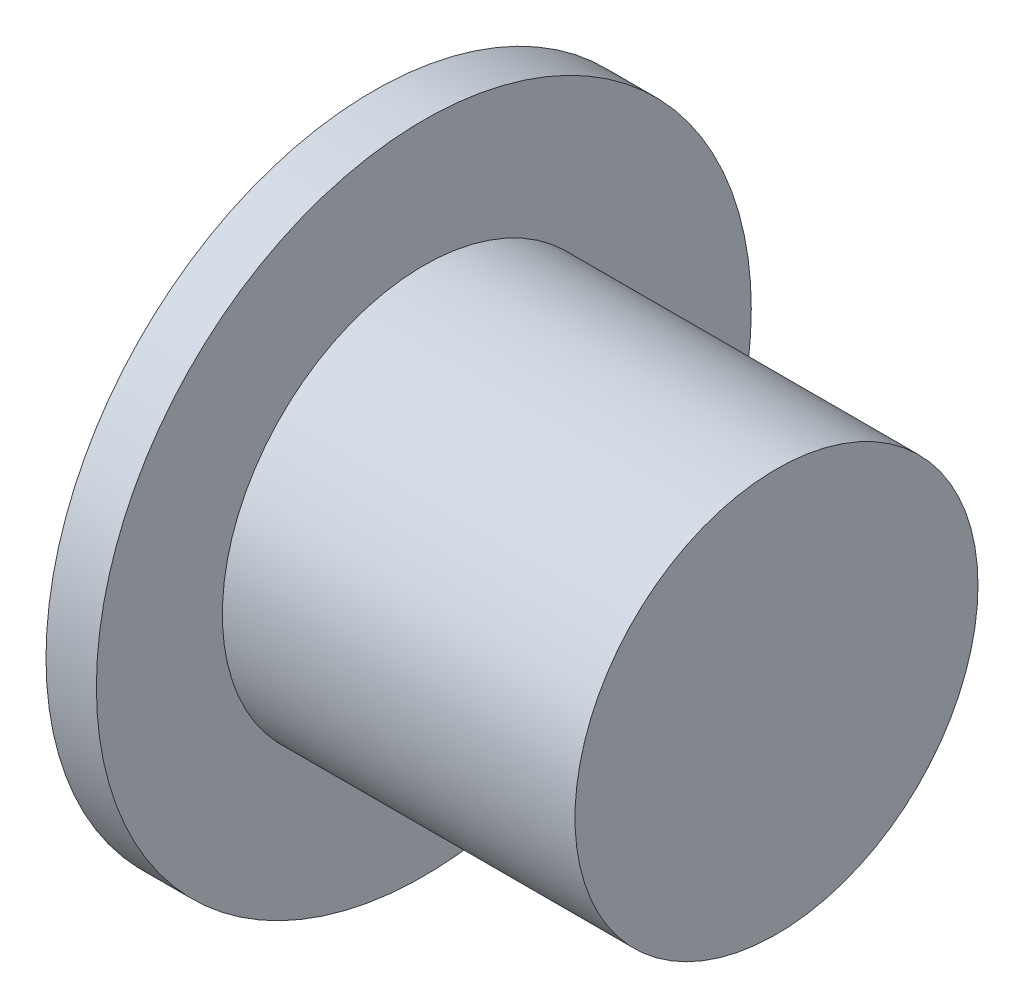
ISO-10303-21;
HEADER;
FILE_DESCRIPTION(('STEP AP214'),'2;1');
FILE_NAME('part.step','',(''),(''),'','','');
FILE_SCHEMA(('AUTOMOTIVE_DESIGN { 1 0 10303 214 1 1 1 1 }'));
ENDSEC;
DATA;
#1=APPLICATION_CONTEXT('core data for automotive mechanical design processes');
#2=APPLICATION_PROTOCOL_DEFINITION('international standard','automotive_design',2000,#1);
#3=PRODUCT_CONTEXT('',#1,'mechanical');
#4=PRODUCT('Part','Part','',(#3));
#5=PRODUCT_RELATED_PRODUCT_CATEGORY('part','',(#4));
#6=PRODUCT_DEFINITION_FORMATION('','',#4);
#7=PRODUCT_DEFINITION_CONTEXT('part definition',#1,'design');
#8=PRODUCT_DEFINITION('design','',#6,#7);
#9=PRODUCT_DEFINITION_SHAPE('','',#8);
#10=(LENGTH_UNIT() NAMED_UNIT(*) SI_UNIT(.MILLI.,.METRE.));
#11=(NAMED_UNIT(*) PLANE_ANGLE_UNIT() SI_UNIT($,.RADIAN.));
#12=(NAMED_UNIT(*) SI_UNIT($,.STERADIAN.) SOLID_ANGLE_UNIT());
#13=UNCERTAINTY_MEASURE_WITH_UNIT(LENGTH_MEASURE(1.E-05),#10,'distance_accuracy_value','');
#14=(GEOMETRIC_REPRESENTATION_CONTEXT(3) GLOBAL_UNCERTAINTY_ASSIGNED_CONTEXT((#13)) GLOBAL_UNIT_ASSIGNED_CONTEXT((#10,
#11,#12)) REPRESENTATION_CONTEXT('',''));
#15=CARTESIAN_POINT('',(0.,0.,0.));
#16=DIRECTION('',(0.,0.,1.));
#17=DIRECTION('',(1.,0.,0.));
#18=AXIS2_PLACEMENT_3D('',#15,#16,#17);
#19=CARTESIAN_POINT('',(-7.,0.,0.));
#20=DIRECTION('',(1.,0.,0.));
#21=DIRECTION('',(0.,0.,-1.));
#22=AXIS2_PLACEMENT_3D('',#19,#20,#21);
#23=CYLINDRICAL_SURFACE('',#22,4.);
#24=CARTESIAN_POINT('',(-7.,0.,0.));
#25=DIRECTION('',(1.,0.,0.));
#26=DIRECTION('',(0.,0.,-1.));
#27=AXIS2_PLACEMENT_3D('',#24,#25,#26);
#28=CIRCLE('',#27,4.);
#29=CARTESIAN_POINT('',(-7.,0.,-4.));
#30=VERTEX_POINT('',#29);
#31=EDGE_CURVE('E40',#30,#30,#28,.T.);
#32=ORIENTED_EDGE('',*,*,#31,.T.);
#33=EDGE_LOOP('',(#32));
#34=FACE_BOUND('',#33,.T.);
#35=CARTESIAN_POINT('',(0.,0.,0.));
#36=DIRECTION('',(1.,0.,0.));
#37=DIRECTION('',(0.,0.,-1.));
#38=AXIS2_PLACEMENT_3D('',#35,#36,#37);
#39=CIRCLE('',#38,4.);
#40=CARTESIAN_POINT('',(0.,0.,-4.));
#41=VERTEX_POINT('',#40);
#42=EDGE_CURVE('E10',#41,#41,#39,.T.);
#43=ORIENTED_EDGE('',*,*,#42,.F.);
#44=EDGE_LOOP('',(#43));
#45=FACE_BOUND('',#44,.T.);
#46=ADVANCED_FACE('F34',(#34,#45),#23,.T.);
#47=CARTESIAN_POINT('',(0.,0.,0.));
#48=DIRECTION('',(1.,0.,0.));
#49=DIRECTION('',(0.,0.,-1.));
#50=AXIS2_PLACEMENT_3D('',#47,#48,#49);
#51=PLANE('',#50);
#52=ORIENTED_EDGE('',*,*,#42,.T.);
#53=EDGE_LOOP('',(#52));
#54=FACE_BOUND('',#53,.T.);
#55=ADVANCED_FACE('F68',(#54),#51,.T.);
#56=CARTESIAN_POINT('',(-8.,0.,0.));
#57=DIRECTION('',(1.,0.,0.));
#58=DIRECTION('',(0.,0.,-1.));
#59=AXIS2_PLACEMENT_3D('',#56,#57,#58);
#60=CYLINDRICAL_SURFACE('',#59,6.5);
#61=CARTESIAN_POINT('',(-8.,0.,0.));
#62=DIRECTION('',(-1.,0.,0.));
#63=DIRECTION('',(0.,0.,1.));
#64=AXIS2_PLACEMENT_3D('',#61,#62,#63);
#65=CIRCLE('',#64,6.5);
#66=CARTESIAN_POINT('',(-8.,0.,6.5));
#67=VERTEX_POINT('',#66);
#68=EDGE_CURVE('E44',#67,#67,#65,.T.);
#69=ORIENTED_EDGE('',*,*,#68,.F.);
#70=EDGE_LOOP('',(#69));
#71=FACE_BOUND('',#70,.T.);
#72=CARTESIAN_POINT('',(-7.,0.,0.));
#73=DIRECTION('',(-1.,0.,0.));
#74=DIRECTION('',(0.,0.,1.));
#75=AXIS2_PLACEMENT_3D('',#72,#73,#74);
#76=CIRCLE('',#75,6.5);
#77=CARTESIAN_POINT('',(-7.,0.,6.5));
#78=VERTEX_POINT('',#77);
#79=EDGE_CURVE('E48',#78,#78,#76,.T.);
#80=ORIENTED_EDGE('',*,*,#79,.T.);
#81=EDGE_LOOP('',(#80));
#82=FACE_BOUND('',#81,.T.);
#83=ADVANCED_FACE('F54',(#71,#82),#60,.T.);
#84=CARTESIAN_POINT('',(-8.,0.,0.));
#85=DIRECTION('',(-1.,0.,0.));
#86=DIRECTION('',(0.,0.,1.));
#87=AXIS2_PLACEMENT_3D('',#84,#85,#86);
#88=PLANE('',#87);
#89=ORIENTED_EDGE('',*,*,#68,.T.);
#90=EDGE_LOOP('',(#89));
#91=FACE_BOUND('',#90,.T.);
#92=ADVANCED_FACE('F58',(#91),#88,.T.);
#93=CARTESIAN_POINT('',(-7.,0.,0.));
#94=DIRECTION('',(-1.,0.,0.));
#95=DIRECTION('',(0.,0.,1.));
#96=AXIS2_PLACEMENT_3D('',#93,#94,#95);
#97=PLANE('',#96);
#98=ORIENTED_EDGE('',*,*,#31,.F.);
#99=EDGE_LOOP('',(#98));
#100=FACE_BOUND('',#99,.T.);
#101=ORIENTED_EDGE('',*,*,#79,.F.);
#102=EDGE_LOOP('',(#101));
#103=FACE_BOUND('',#102,.T.);
#104=ADVANCED_FACE('F56',(#100,#103),#97,.F.);
#105=CLOSED_SHELL('',(#46,#55,#83,#92,#104));
#106=MANIFOLD_SOLID_BREP('B2',#105);
#107=ADVANCED_BREP_SHAPE_REPRESENTATION('',(#18,#106),#14);
#108=SHAPE_DEFINITION_REPRESENTATION(#9,#107);
ENDSEC;
END-ISO-10303-21;
